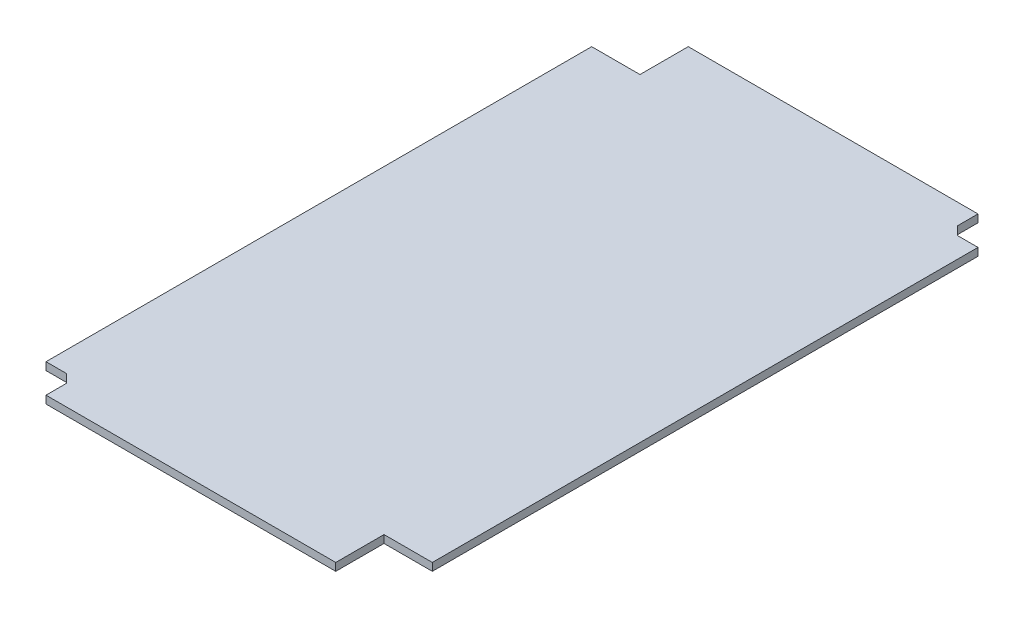
ISO-10303-21;
HEADER;
FILE_DESCRIPTION(('STEP AP214'),'2;1');
FILE_NAME('part.step','',(''),(''),'','','');
FILE_SCHEMA(('AUTOMOTIVE_DESIGN { 1 0 10303 214 1 1 1 1 }'));
ENDSEC;
DATA;
#1=APPLICATION_CONTEXT('core data for automotive mechanical design processes');
#2=APPLICATION_PROTOCOL_DEFINITION('international standard','automotive_design',2000,#1);
#3=PRODUCT_CONTEXT('',#1,'mechanical');
#4=PRODUCT('Part','Part','',(#3));
#5=PRODUCT_RELATED_PRODUCT_CATEGORY('part','',(#4));
#6=PRODUCT_DEFINITION_FORMATION('','',#4);
#7=PRODUCT_DEFINITION_CONTEXT('part definition',#1,'design');
#8=PRODUCT_DEFINITION('design','',#6,#7);
#9=PRODUCT_DEFINITION_SHAPE('','',#8);
#10=(LENGTH_UNIT() NAMED_UNIT(*) SI_UNIT(.MILLI.,.METRE.));
#11=(NAMED_UNIT(*) PLANE_ANGLE_UNIT() SI_UNIT($,.RADIAN.));
#12=(NAMED_UNIT(*) SI_UNIT($,.STERADIAN.) SOLID_ANGLE_UNIT());
#13=UNCERTAINTY_MEASURE_WITH_UNIT(LENGTH_MEASURE(1.E-05),#10,'distance_accuracy_value','');
#14=(GEOMETRIC_REPRESENTATION_CONTEXT(3) GLOBAL_UNCERTAINTY_ASSIGNED_CONTEXT((#13)) GLOBAL_UNIT_ASSIGNED_CONTEXT((#10,
#11,#12)) REPRESENTATION_CONTEXT('',''));
#15=CARTESIAN_POINT('',(0.,0.,0.));
#16=DIRECTION('',(0.,0.,1.));
#17=DIRECTION('',(1.,0.,0.));
#18=AXIS2_PLACEMENT_3D('',#15,#16,#17);
#19=CARTESIAN_POINT('',(8.,1.6,-6.24264068711929));
#20=DIRECTION('',(1.,0.,0.));
#21=DIRECTION('',(0.,0.,-1.));
#22=AXIS2_PLACEMENT_3D('',#19,#20,#21);
#23=PLANE('',#22);
#24=DIRECTION('',(0.,0.,1.));
#25=VECTOR('',#24,1.);
#26=CARTESIAN_POINT('',(8.,0.,-6.24264068711929));
#27=LINE('',#26,#25);
#28=CARTESIAN_POINT('',(8.,0.,-6.24264068711929));
#29=VERTEX_POINT('',#28);
#30=CARTESIAN_POINT('',(8.,0.,-2.));
#31=VERTEX_POINT('',#30);
#32=EDGE_CURVE('E166',#29,#31,#27,.T.);
#33=ORIENTED_EDGE('',*,*,#32,.T.);
#34=DIRECTION('',(0.,-1.,0.));
#35=VECTOR('',#34,1.);
#36=CARTESIAN_POINT('',(8.,1.6,-2.));
#37=LINE('',#36,#35);
#38=CARTESIAN_POINT('',(8.,1.6,-2.));
#39=VERTEX_POINT('',#38);
#40=EDGE_CURVE('E11',#39,#31,#37,.T.);
#41=ORIENTED_EDGE('',*,*,#40,.F.);
#42=DIRECTION('',(0.,0.,1.));
#43=VECTOR('',#42,1.);
#44=CARTESIAN_POINT('',(8.,1.6,-6.24264068711929));
#45=LINE('',#44,#43);
#46=CARTESIAN_POINT('',(8.,1.6,-6.24264068711929));
#47=VERTEX_POINT('',#46);
#48=EDGE_CURVE('E194',#47,#39,#45,.T.);
#49=ORIENTED_EDGE('',*,*,#48,.F.);
#50=DIRECTION('',(0.,-1.,0.));
#51=VECTOR('',#50,1.);
#52=CARTESIAN_POINT('',(8.,1.6,-6.24264068711929));
#53=LINE('',#52,#51);
#54=EDGE_CURVE('E162',#47,#29,#53,.T.);
#55=ORIENTED_EDGE('',*,*,#54,.T.);
#56=EDGE_LOOP('',(#33,#41,#49,#55));
#57=FACE_BOUND('',#56,.T.);
#58=ADVANCED_FACE('F34',(#57),#23,.F.);
#59=CARTESIAN_POINT('',(8.,1.6,-2.));
#60=DIRECTION('',(0.,0.,-1.));
#61=DIRECTION('',(-1.,0.,0.));
#62=AXIS2_PLACEMENT_3D('',#59,#60,#61);
#63=PLANE('',#62);
#64=DIRECTION('',(1.,0.,0.));
#65=VECTOR('',#64,1.);
#66=CARTESIAN_POINT('',(8.,0.,-2.));
#67=LINE('',#66,#65);
#68=CARTESIAN_POINT('',(68.,0.,-2.));
#69=VERTEX_POINT('',#68);
#70=EDGE_CURVE('E169',#31,#69,#67,.T.);
#71=ORIENTED_EDGE('',*,*,#70,.T.);
#72=DIRECTION('',(0.,-1.,0.));
#73=VECTOR('',#72,1.);
#74=CARTESIAN_POINT('',(68.,1.6,-2.));
#75=LINE('',#74,#73);
#76=CARTESIAN_POINT('',(68.,1.6,-2.));
#77=VERTEX_POINT('',#76);
#78=EDGE_CURVE('E42',#77,#69,#75,.T.);
#79=ORIENTED_EDGE('',*,*,#78,.F.);
#80=DIRECTION('',(1.,0.,0.));
#81=VECTOR('',#80,1.);
#82=CARTESIAN_POINT('',(8.,1.6,-2.));
#83=LINE('',#82,#81);
#84=EDGE_CURVE('E111',#39,#77,#83,.T.);
#85=ORIENTED_EDGE('',*,*,#84,.F.);
#86=ORIENTED_EDGE('',*,*,#40,.T.);
#87=EDGE_LOOP('',(#71,#79,#85,#86));
#88=FACE_BOUND('',#87,.T.);
#89=ADVANCED_FACE('F281',(#88),#63,.F.);
#90=CARTESIAN_POINT('',(68.,1.6,-2.));
#91=DIRECTION('',(-1.,0.,0.));
#92=DIRECTION('',(0.,0.,1.));
#93=AXIS2_PLACEMENT_3D('',#90,#91,#92);
#94=PLANE('',#93);
#95=DIRECTION('',(0.,0.,-1.));
#96=VECTOR('',#95,1.);
#97=CARTESIAN_POINT('',(68.,0.,-2.));
#98=LINE('',#97,#96);
#99=CARTESIAN_POINT('',(68.,0.,-12.));
#100=VERTEX_POINT('',#99);
#101=EDGE_CURVE('E171',#69,#100,#98,.T.);
#102=ORIENTED_EDGE('',*,*,#101,.T.);
#103=DIRECTION('',(0.,-1.,0.));
#104=VECTOR('',#103,1.);
#105=CARTESIAN_POINT('',(68.,1.6,-12.));
#106=LINE('',#105,#104);
#107=CARTESIAN_POINT('',(68.,1.6,-12.));
#108=VERTEX_POINT('',#107);
#109=EDGE_CURVE('E219',#108,#100,#106,.T.);
#110=ORIENTED_EDGE('',*,*,#109,.F.);
#111=DIRECTION('',(0.,0.,-1.));
#112=VECTOR('',#111,1.);
#113=CARTESIAN_POINT('',(68.,1.6,-2.));
#114=LINE('',#113,#112);
#115=EDGE_CURVE('E227',#77,#108,#114,.T.);
#116=ORIENTED_EDGE('',*,*,#115,.F.);
#117=ORIENTED_EDGE('',*,*,#78,.T.);
#118=EDGE_LOOP('',(#102,#110,#116,#117));
#119=FACE_BOUND('',#118,.T.);
#120=ADVANCED_FACE('F225',(#119),#94,.F.);
#121=CARTESIAN_POINT('',(68.,1.6,-12.));
#122=DIRECTION('',(0.,0.,-1.));
#123=DIRECTION('',(-1.,0.,0.));
#124=AXIS2_PLACEMENT_3D('',#121,#122,#123);
#125=PLANE('',#124);
#126=DIRECTION('',(1.,0.,0.));
#127=VECTOR('',#126,1.);
#128=CARTESIAN_POINT('',(68.,0.,-12.));
#129=LINE('',#128,#127);
#130=CARTESIAN_POINT('',(78.,0.,-12.));
#131=VERTEX_POINT('',#130);
#132=EDGE_CURVE('E173',#100,#131,#129,.T.);
#133=ORIENTED_EDGE('',*,*,#132,.T.);
#134=DIRECTION('',(0.,-1.,0.));
#135=VECTOR('',#134,1.);
#136=CARTESIAN_POINT('',(78.,1.6,-12.));
#137=LINE('',#136,#135);
#138=CARTESIAN_POINT('',(78.,1.6,-12.));
#139=VERTEX_POINT('',#138);
#140=EDGE_CURVE('E216',#139,#131,#137,.T.);
#141=ORIENTED_EDGE('',*,*,#140,.F.);
#142=DIRECTION('',(1.,0.,0.));
#143=VECTOR('',#142,1.);
#144=CARTESIAN_POINT('',(68.,1.6,-12.));
#145=LINE('',#144,#143);
#146=EDGE_CURVE('E244',#108,#139,#145,.T.);
#147=ORIENTED_EDGE('',*,*,#146,.F.);
#148=ORIENTED_EDGE('',*,*,#109,.T.);
#149=EDGE_LOOP('',(#133,#141,#147,#148));
#150=FACE_BOUND('',#149,.T.);
#151=ADVANCED_FACE('F235',(#150),#125,.F.);
#152=CARTESIAN_POINT('',(78.,1.6,-12.));
#153=DIRECTION('',(-1.,0.,0.));
#154=DIRECTION('',(0.,0.,1.));
#155=AXIS2_PLACEMENT_3D('',#152,#153,#154);
#156=PLANE('',#155);
#157=DIRECTION('',(0.,0.,-1.));
#158=VECTOR('',#157,1.);
#159=CARTESIAN_POINT('',(78.,0.,-12.));
#160=LINE('',#159,#158);
#161=CARTESIAN_POINT('',(78.,0.,-125.));
#162=VERTEX_POINT('',#161);
#163=EDGE_CURVE('E175',#131,#162,#160,.T.);
#164=ORIENTED_EDGE('',*,*,#163,.T.);
#165=DIRECTION('',(0.,-1.,0.));
#166=VECTOR('',#165,1.);
#167=CARTESIAN_POINT('',(78.,1.6,-125.));
#168=LINE('',#167,#166);
#169=CARTESIAN_POINT('',(78.,1.6,-125.));
#170=VERTEX_POINT('',#169);
#171=EDGE_CURVE('E213',#170,#162,#168,.T.);
#172=ORIENTED_EDGE('',*,*,#171,.F.);
#173=DIRECTION('',(0.,0.,-1.));
#174=VECTOR('',#173,1.);
#175=CARTESIAN_POINT('',(78.,1.6,-12.));
#176=LINE('',#175,#174);
#177=EDGE_CURVE('E241',#139,#170,#176,.T.);
#178=ORIENTED_EDGE('',*,*,#177,.F.);
#179=ORIENTED_EDGE('',*,*,#140,.T.);
#180=EDGE_LOOP('',(#164,#172,#178,#179));
#181=FACE_BOUND('',#180,.T.);
#182=ADVANCED_FACE('F239',(#181),#156,.F.);
#183=CARTESIAN_POINT('',(73.7573593128807,1.6,-125.));
#184=DIRECTION('',(0.,0.,1.));
#185=DIRECTION('',(1.,0.,0.));
#186=AXIS2_PLACEMENT_3D('',#183,#184,#185);
#187=PLANE('',#186);
#188=DIRECTION('',(-1.,0.,0.));
#189=VECTOR('',#188,1.);
#190=CARTESIAN_POINT('',(73.7573593128807,0.,-125.));
#191=LINE('',#190,#189);
#192=CARTESIAN_POINT('',(73.7573593128807,0.,-125.));
#193=VERTEX_POINT('',#192);
#194=EDGE_CURVE('E178',#162,#193,#191,.T.);
#195=ORIENTED_EDGE('',*,*,#194,.T.);
#196=DIRECTION('',(0.,-1.,0.));
#197=VECTOR('',#196,1.);
#198=CARTESIAN_POINT('',(73.7573593128807,1.6,-125.));
#199=LINE('',#198,#197);
#200=CARTESIAN_POINT('',(73.7573593128807,1.6,-125.));
#201=VERTEX_POINT('',#200);
#202=EDGE_CURVE('E210',#201,#193,#199,.T.);
#203=ORIENTED_EDGE('',*,*,#202,.F.);
#204=DIRECTION('',(-1.,0.,0.));
#205=VECTOR('',#204,1.);
#206=CARTESIAN_POINT('',(75.,1.6,-125.));
#207=LINE('',#206,#205);
#208=EDGE_CURVE('E243',#170,#201,#207,.T.);
#209=ORIENTED_EDGE('',*,*,#208,.F.);
#210=ORIENTED_EDGE('',*,*,#171,.T.);
#211=EDGE_LOOP('',(#195,#203,#209,#210));
#212=FACE_BOUND('',#211,.T.);
#213=ADVANCED_FACE('F294',(#212),#187,.F.);
#214=CARTESIAN_POINT('',(73.7573593128807,1.6,-125.));
#215=DIRECTION('',(-0.707106781186548,0.,0.707106781186548));
#216=DIRECTION('',(0.707106781186548,0.,0.707106781186548));
#217=AXIS2_PLACEMENT_3D('',#214,#215,#216);
#218=PLANE('',#217);
#219=DIRECTION('',(-0.707106781186547,0.,-0.707106781186547));
#220=VECTOR('',#219,1.);
#221=CARTESIAN_POINT('',(73.7573593128807,0.,-125.));
#222=LINE('',#221,#220);
#223=CARTESIAN_POINT('',(72.,0.,-126.757359312881));
#224=VERTEX_POINT('',#223);
#225=EDGE_CURVE('E180',#193,#224,#222,.T.);
#226=ORIENTED_EDGE('',*,*,#225,.T.);
#227=DIRECTION('',(0.,-1.,0.));
#228=VECTOR('',#227,1.);
#229=CARTESIAN_POINT('',(72.,1.6,-126.757359312881));
#230=LINE('',#229,#228);
#231=CARTESIAN_POINT('',(72.,1.6,-126.757359312881));
#232=VERTEX_POINT('',#231);
#233=EDGE_CURVE('E207',#232,#224,#230,.T.);
#234=ORIENTED_EDGE('',*,*,#233,.F.);
#235=DIRECTION('',(-0.707106781186547,0.,-0.707106781186547));
#236=VECTOR('',#235,1.);
#237=CARTESIAN_POINT('',(73.7573593128807,1.6,-125.));
#238=LINE('',#237,#236);
#239=EDGE_CURVE('E246',#201,#232,#238,.T.);
#240=ORIENTED_EDGE('',*,*,#239,.F.);
#241=ORIENTED_EDGE('',*,*,#202,.T.);
#242=EDGE_LOOP('',(#226,#234,#240,#241));
#243=FACE_BOUND('',#242,.T.);
#244=ADVANCED_FACE('F297',(#243),#218,.F.);
#245=CARTESIAN_POINT('',(72.,1.6,-128.));
#246=DIRECTION('',(-1.,0.,0.));
#247=DIRECTION('',(0.,0.,1.));
#248=AXIS2_PLACEMENT_3D('',#245,#246,#247);
#249=PLANE('',#248);
#250=DIRECTION('',(0.,0.,-1.));
#251=VECTOR('',#250,1.);
#252=CARTESIAN_POINT('',(72.,0.,-128.));
#253=LINE('',#252,#251);
#254=CARTESIAN_POINT('',(72.,0.,-131.));
#255=VERTEX_POINT('',#254);
#256=EDGE_CURVE('E183',#224,#255,#253,.T.);
#257=ORIENTED_EDGE('',*,*,#256,.T.);
#258=DIRECTION('',(0.,-1.,0.));
#259=VECTOR('',#258,1.);
#260=CARTESIAN_POINT('',(72.,1.6,-131.));
#261=LINE('',#260,#259);
#262=CARTESIAN_POINT('',(72.,1.6,-131.));
#263=VERTEX_POINT('',#262);
#264=EDGE_CURVE('E204',#263,#255,#261,.T.);
#265=ORIENTED_EDGE('',*,*,#264,.F.);
#266=DIRECTION('',(0.,0.,-1.));
#267=VECTOR('',#266,1.);
#268=CARTESIAN_POINT('',(72.,1.6,-128.));
#269=LINE('',#268,#267);
#270=EDGE_CURVE('E252',#232,#263,#269,.T.);
#271=ORIENTED_EDGE('',*,*,#270,.F.);
#272=ORIENTED_EDGE('',*,*,#233,.T.);
#273=EDGE_LOOP('',(#257,#265,#271,#272));
#274=FACE_BOUND('',#273,.T.);
#275=ADVANCED_FACE('F301',(#274),#249,.F.);
#276=CARTESIAN_POINT('',(12.,1.6,-131.));
#277=DIRECTION('',(0.,0.,1.));
#278=DIRECTION('',(1.,0.,0.));
#279=AXIS2_PLACEMENT_3D('',#276,#277,#278);
#280=PLANE('',#279);
#281=DIRECTION('',(-1.,0.,0.));
#282=VECTOR('',#281,1.);
#283=CARTESIAN_POINT('',(12.,0.,-131.));
#284=LINE('',#283,#282);
#285=CARTESIAN_POINT('',(12.,0.,-131.));
#286=VERTEX_POINT('',#285);
#287=EDGE_CURVE('E185',#255,#286,#284,.T.);
#288=ORIENTED_EDGE('',*,*,#287,.T.);
#289=DIRECTION('',(0.,-1.,0.));
#290=VECTOR('',#289,1.);
#291=CARTESIAN_POINT('',(12.,1.6,-131.));
#292=LINE('',#291,#290);
#293=CARTESIAN_POINT('',(12.,1.6,-131.));
#294=VERTEX_POINT('',#293);
#295=EDGE_CURVE('E201',#294,#286,#292,.T.);
#296=ORIENTED_EDGE('',*,*,#295,.F.);
#297=DIRECTION('',(-1.,0.,0.));
#298=VECTOR('',#297,1.);
#299=CARTESIAN_POINT('',(12.,1.6,-131.));
#300=LINE('',#299,#298);
#301=EDGE_CURVE('E254',#263,#294,#300,.T.);
#302=ORIENTED_EDGE('',*,*,#301,.F.);
#303=ORIENTED_EDGE('',*,*,#264,.T.);
#304=EDGE_LOOP('',(#288,#296,#302,#303));
#305=FACE_BOUND('',#304,.T.);
#306=ADVANCED_FACE('F305',(#305),#280,.F.);
#307=CARTESIAN_POINT('',(12.,1.6,-121.));
#308=DIRECTION('',(1.,0.,0.));
#309=DIRECTION('',(0.,0.,-1.));
#310=AXIS2_PLACEMENT_3D('',#307,#308,#309);
#311=PLANE('',#310);
#312=DIRECTION('',(0.,0.,1.));
#313=VECTOR('',#312,1.);
#314=CARTESIAN_POINT('',(12.,0.,-121.));
#315=LINE('',#314,#313);
#316=CARTESIAN_POINT('',(12.,0.,-121.));
#317=VERTEX_POINT('',#316);
#318=EDGE_CURVE('E187',#286,#317,#315,.T.);
#319=ORIENTED_EDGE('',*,*,#318,.T.);
#320=DIRECTION('',(0.,-1.,0.));
#321=VECTOR('',#320,1.);
#322=CARTESIAN_POINT('',(12.,1.6,-121.));
#323=LINE('',#322,#321);
#324=CARTESIAN_POINT('',(12.,1.6,-121.));
#325=VERTEX_POINT('',#324);
#326=EDGE_CURVE('E198',#325,#317,#323,.T.);
#327=ORIENTED_EDGE('',*,*,#326,.F.);
#328=DIRECTION('',(0.,0.,1.));
#329=VECTOR('',#328,1.);
#330=CARTESIAN_POINT('',(12.,1.6,-121.));
#331=LINE('',#330,#329);
#332=EDGE_CURVE('E256',#294,#325,#331,.T.);
#333=ORIENTED_EDGE('',*,*,#332,.F.);
#334=ORIENTED_EDGE('',*,*,#295,.T.);
#335=EDGE_LOOP('',(#319,#327,#333,#334));
#336=FACE_BOUND('',#335,.T.);
#337=ADVANCED_FACE('F262',(#336),#311,.F.);
#338=CARTESIAN_POINT('',(2.,1.6,-121.));
#339=DIRECTION('',(0.,0.,1.));
#340=DIRECTION('',(1.,0.,0.));
#341=AXIS2_PLACEMENT_3D('',#338,#339,#340);
#342=PLANE('',#341);
#343=DIRECTION('',(-1.,0.,0.));
#344=VECTOR('',#343,1.);
#345=CARTESIAN_POINT('',(2.,0.,-121.));
#346=LINE('',#345,#344);
#347=CARTESIAN_POINT('',(2.,0.,-121.));
#348=VERTEX_POINT('',#347);
#349=EDGE_CURVE('E189',#317,#348,#346,.T.);
#350=ORIENTED_EDGE('',*,*,#349,.T.);
#351=DIRECTION('',(0.,-1.,0.));
#352=VECTOR('',#351,1.);
#353=CARTESIAN_POINT('',(2.,1.6,-121.));
#354=LINE('',#353,#352);
#355=CARTESIAN_POINT('',(2.,1.6,-121.));
#356=VERTEX_POINT('',#355);
#357=EDGE_CURVE('E157',#356,#348,#354,.T.);
#358=ORIENTED_EDGE('',*,*,#357,.F.);
#359=DIRECTION('',(-1.,0.,0.));
#360=VECTOR('',#359,1.);
#361=CARTESIAN_POINT('',(2.,1.6,-121.));
#362=LINE('',#361,#360);
#363=EDGE_CURVE('E148',#325,#356,#362,.T.);
#364=ORIENTED_EDGE('',*,*,#363,.F.);
#365=ORIENTED_EDGE('',*,*,#326,.T.);
#366=EDGE_LOOP('',(#350,#358,#364,#365));
#367=FACE_BOUND('',#366,.T.);
#368=ADVANCED_FACE('F266',(#367),#342,.F.);
#369=CARTESIAN_POINT('',(2.,1.6,-8.));
#370=DIRECTION('',(1.,0.,0.));
#371=DIRECTION('',(0.,0.,-1.));
#372=AXIS2_PLACEMENT_3D('',#369,#370,#371);
#373=PLANE('',#372);
#374=DIRECTION('',(0.,0.,1.));
#375=VECTOR('',#374,1.);
#376=CARTESIAN_POINT('',(2.,0.,-8.));
#377=LINE('',#376,#375);
#378=CARTESIAN_POINT('',(2.,0.,-8.));
#379=VERTEX_POINT('',#378);
#380=EDGE_CURVE('E156',#348,#379,#377,.T.);
#381=ORIENTED_EDGE('',*,*,#380,.T.);
#382=DIRECTION('',(0.,-1.,0.));
#383=VECTOR('',#382,1.);
#384=CARTESIAN_POINT('',(2.,1.6,-8.));
#385=LINE('',#384,#383);
#386=CARTESIAN_POINT('',(2.,1.6,-8.));
#387=VERTEX_POINT('',#386);
#388=EDGE_CURVE('E153',#387,#379,#385,.T.);
#389=ORIENTED_EDGE('',*,*,#388,.F.);
#390=DIRECTION('',(0.,0.,1.));
#391=VECTOR('',#390,1.);
#392=CARTESIAN_POINT('',(2.,1.6,-8.));
#393=LINE('',#392,#391);
#394=EDGE_CURVE('E142',#356,#387,#393,.T.);
#395=ORIENTED_EDGE('',*,*,#394,.F.);
#396=ORIENTED_EDGE('',*,*,#357,.T.);
#397=EDGE_LOOP('',(#381,#389,#395,#396));
#398=FACE_BOUND('',#397,.T.);
#399=ADVANCED_FACE('F154',(#398),#373,.F.);
#400=CARTESIAN_POINT('',(2.,1.6,-8.));
#401=DIRECTION('',(0.,0.,-1.));
#402=DIRECTION('',(-1.,0.,0.));
#403=AXIS2_PLACEMENT_3D('',#400,#401,#402);
#404=PLANE('',#403);
#405=DIRECTION('',(1.,0.,0.));
#406=VECTOR('',#405,1.);
#407=CARTESIAN_POINT('',(2.,0.,-8.));
#408=LINE('',#407,#406);
#409=CARTESIAN_POINT('',(6.24264068711928,0.,-8.));
#410=VERTEX_POINT('',#409);
#411=EDGE_CURVE('E97',#379,#410,#408,.T.);
#412=ORIENTED_EDGE('',*,*,#411,.T.);
#413=DIRECTION('',(0.,-1.,0.));
#414=VECTOR('',#413,1.);
#415=CARTESIAN_POINT('',(6.24264068711928,1.6,-8.));
#416=LINE('',#415,#414);
#417=CARTESIAN_POINT('',(6.24264068711928,1.6,-8.));
#418=VERTEX_POINT('',#417);
#419=EDGE_CURVE('E158',#418,#410,#416,.T.);
#420=ORIENTED_EDGE('',*,*,#419,.F.);
#421=DIRECTION('',(1.,0.,0.));
#422=VECTOR('',#421,1.);
#423=CARTESIAN_POINT('',(2.,1.6,-8.));
#424=LINE('',#423,#422);
#425=EDGE_CURVE('E146',#387,#418,#424,.T.);
#426=ORIENTED_EDGE('',*,*,#425,.F.);
#427=ORIENTED_EDGE('',*,*,#388,.T.);
#428=EDGE_LOOP('',(#412,#420,#426,#427));
#429=FACE_BOUND('',#428,.T.);
#430=ADVANCED_FACE('F160',(#429),#404,.F.);
#431=CARTESIAN_POINT('',(6.24264068711928,1.6,-8.));
#432=DIRECTION('',(0.707106781186546,0.,-0.707106781186549));
#433=DIRECTION('',(-0.707106781186549,0.,-0.707106781186546));
#434=AXIS2_PLACEMENT_3D('',#431,#432,#433);
#435=PLANE('',#434);
#436=DIRECTION('',(0.707106781186549,0.,0.707106781186546));
#437=VECTOR('',#436,1.);
#438=CARTESIAN_POINT('',(6.24264068711928,0.,-8.));
#439=LINE('',#438,#437);
#440=EDGE_CURVE('E103',#410,#29,#439,.T.);
#441=ORIENTED_EDGE('',*,*,#440,.T.);
#442=ORIENTED_EDGE('',*,*,#54,.F.);
#443=DIRECTION('',(0.707106781186549,0.,0.707106781186546));
#444=VECTOR('',#443,1.);
#445=CARTESIAN_POINT('',(6.24264068711928,1.6,-8.));
#446=LINE('',#445,#444);
#447=EDGE_CURVE('E50',#418,#47,#446,.T.);
#448=ORIENTED_EDGE('',*,*,#447,.F.);
#449=ORIENTED_EDGE('',*,*,#419,.T.);
#450=EDGE_LOOP('',(#441,#442,#448,#449));
#451=FACE_BOUND('',#450,.T.);
#452=ADVANCED_FACE('F270',(#451),#435,.F.);
#453=CARTESIAN_POINT('',(0.,1.6,0.));
#454=DIRECTION('',(0.,1.,0.));
#455=DIRECTION('',(0.,0.,1.));
#456=AXIS2_PLACEMENT_3D('',#453,#454,#455);
#457=PLANE('',#456);
#458=ORIENTED_EDGE('',*,*,#48,.T.);
#459=ORIENTED_EDGE('',*,*,#84,.T.);
#460=ORIENTED_EDGE('',*,*,#115,.T.);
#461=ORIENTED_EDGE('',*,*,#146,.T.);
#462=ORIENTED_EDGE('',*,*,#177,.T.);
#463=ORIENTED_EDGE('',*,*,#208,.T.);
#464=ORIENTED_EDGE('',*,*,#239,.T.);
#465=ORIENTED_EDGE('',*,*,#270,.T.);
#466=ORIENTED_EDGE('',*,*,#301,.T.);
#467=ORIENTED_EDGE('',*,*,#332,.T.);
#468=ORIENTED_EDGE('',*,*,#363,.T.);
#469=ORIENTED_EDGE('',*,*,#394,.T.);
#470=ORIENTED_EDGE('',*,*,#425,.T.);
#471=ORIENTED_EDGE('',*,*,#447,.T.);
#472=EDGE_LOOP('',(#458,#459,#460,#461,#462,#463,#464,#465,#466,#467,#468,#469,#470,#471));
#473=FACE_BOUND('',#472,.T.);
#474=ADVANCED_FACE('F144',(#473),#457,.T.);
#475=CARTESIAN_POINT('',(0.,0.,0.));
#476=DIRECTION('',(0.,1.,0.));
#477=DIRECTION('',(0.,0.,1.));
#478=AXIS2_PLACEMENT_3D('',#475,#476,#477);
#479=PLANE('',#478);
#480=ORIENTED_EDGE('',*,*,#32,.F.);
#481=ORIENTED_EDGE('',*,*,#440,.F.);
#482=ORIENTED_EDGE('',*,*,#411,.F.);
#483=ORIENTED_EDGE('',*,*,#380,.F.);
#484=ORIENTED_EDGE('',*,*,#349,.F.);
#485=ORIENTED_EDGE('',*,*,#318,.F.);
#486=ORIENTED_EDGE('',*,*,#287,.F.);
#487=ORIENTED_EDGE('',*,*,#256,.F.);
#488=ORIENTED_EDGE('',*,*,#225,.F.);
#489=ORIENTED_EDGE('',*,*,#194,.F.);
#490=ORIENTED_EDGE('',*,*,#163,.F.);
#491=ORIENTED_EDGE('',*,*,#132,.F.);
#492=ORIENTED_EDGE('',*,*,#101,.F.);
#493=ORIENTED_EDGE('',*,*,#70,.F.);
#494=EDGE_LOOP('',(#480,#481,#482,#483,#484,#485,#486,#487,#488,#489,#490,#491,#492,#493));
#495=FACE_BOUND('',#494,.T.);
#496=ADVANCED_FACE('F231',(#495),#479,.F.);
#497=CLOSED_SHELL('',(#58,#89,#120,#151,#182,#213,#244,#275,#306,#337,#368,#399,#430,#452,#474,#496));
#498=MANIFOLD_SOLID_BREP('B2',#497);
#499=ADVANCED_BREP_SHAPE_REPRESENTATION('',(#18,#498),#14);
#500=SHAPE_DEFINITION_REPRESENTATION(#9,#499);
ENDSEC;
END-ISO-10303-21;
